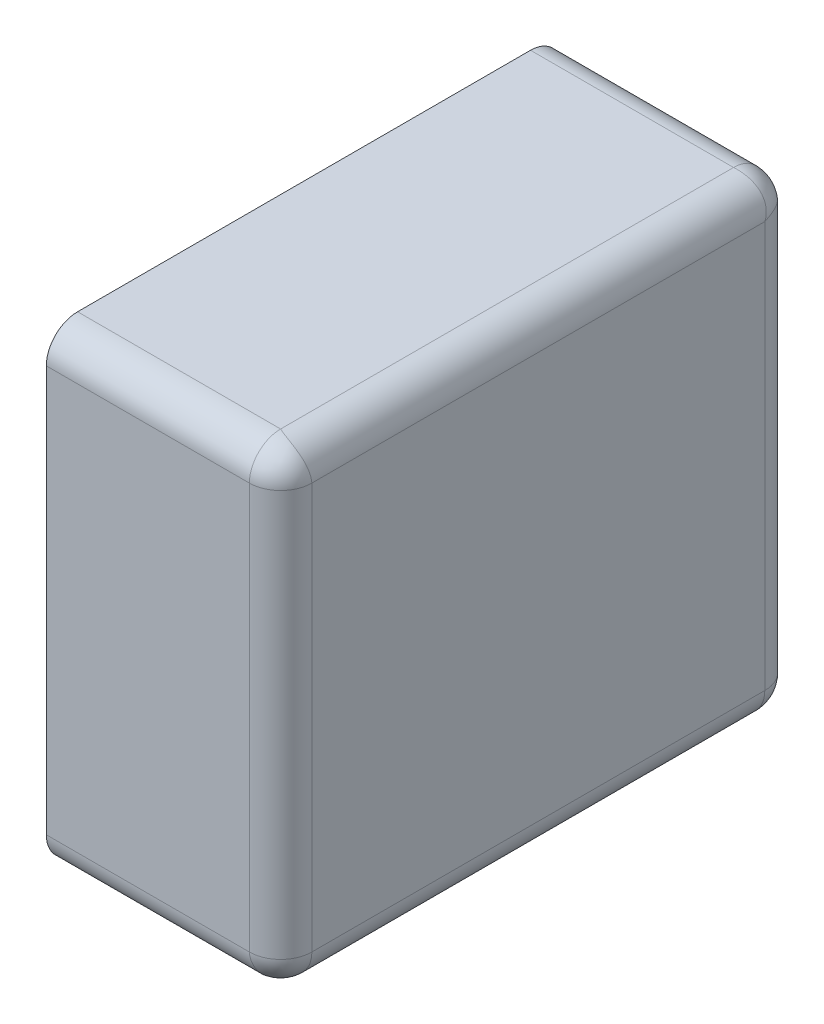
ISO-10303-21;
HEADER;
FILE_DESCRIPTION(('STEP AP214'),'2;1');
FILE_NAME('part.step','',(''),(''),'','','');
FILE_SCHEMA(('AUTOMOTIVE_DESIGN { 1 0 10303 214 1 1 1 1 }'));
ENDSEC;
DATA;
#1=APPLICATION_CONTEXT('core data for automotive mechanical design processes');
#2=APPLICATION_PROTOCOL_DEFINITION('international standard','automotive_design',2000,#1);
#3=PRODUCT_CONTEXT('',#1,'mechanical');
#4=PRODUCT('Part','Part','',(#3));
#5=PRODUCT_RELATED_PRODUCT_CATEGORY('part','',(#4));
#6=PRODUCT_DEFINITION_FORMATION('','',#4);
#7=PRODUCT_DEFINITION_CONTEXT('part definition',#1,'design');
#8=PRODUCT_DEFINITION('design','',#6,#7);
#9=PRODUCT_DEFINITION_SHAPE('','',#8);
#10=(LENGTH_UNIT() NAMED_UNIT(*) SI_UNIT(.MILLI.,.METRE.));
#11=(NAMED_UNIT(*) PLANE_ANGLE_UNIT() SI_UNIT($,.RADIAN.));
#12=(NAMED_UNIT(*) SI_UNIT($,.STERADIAN.) SOLID_ANGLE_UNIT());
#13=UNCERTAINTY_MEASURE_WITH_UNIT(LENGTH_MEASURE(1.E-05),#10,'distance_accuracy_value','');
#14=(GEOMETRIC_REPRESENTATION_CONTEXT(3) GLOBAL_UNCERTAINTY_ASSIGNED_CONTEXT((#13)) GLOBAL_UNIT_ASSIGNED_CONTEXT((#10,
#11,#12)) REPRESENTATION_CONTEXT('',''));
#15=CARTESIAN_POINT('',(0.,0.,0.));
#16=DIRECTION('',(0.,0.,1.));
#17=DIRECTION('',(1.,0.,0.));
#18=AXIS2_PLACEMENT_3D('',#15,#16,#17);
#19=CARTESIAN_POINT('',(0.28,0.611666689445808,0.02));
#20=DIRECTION('',(-0.816496580927726,-0.408248290463864,-0.408248290463862));
#21=DIRECTION('',(0.577350269189626,-0.577350269189626,-0.577350269189626));
#22=AXIS2_PLACEMENT_3D('',#19,#20,#21);
#23=SPHERICAL_SURFACE('',#22,0.02);
#24=CARTESIAN_POINT('',(0.28,0.611666689445808,0.02));
#25=DIRECTION('',(1.,0.,0.));
#26=DIRECTION('',(0.,0.,-1.));
#27=AXIS2_PLACEMENT_3D('',#24,#25,#26);
#28=CIRCLE('',#27,0.02);
#29=CARTESIAN_POINT('',(0.28,0.591666689445808,0.02));
#30=VERTEX_POINT('',#29);
#31=CARTESIAN_POINT('',(0.28,0.611666689445808,0.));
#32=VERTEX_POINT('',#31);
#33=EDGE_CURVE('E11',#30,#32,#28,.T.);
#34=ORIENTED_EDGE('',*,*,#33,.T.);
#35=CARTESIAN_POINT('',(0.28,0.611666689445808,0.02));
#36=DIRECTION('',(0.,-1.,0.));
#37=DIRECTION('',(1.,0.,0.));
#38=AXIS2_PLACEMENT_3D('',#35,#36,#37);
#39=CIRCLE('',#38,0.02);
#40=CARTESIAN_POINT('',(0.3,0.611666689445808,0.02));
#41=VERTEX_POINT('',#40);
#42=EDGE_CURVE('E24',#32,#41,#39,.T.);
#43=ORIENTED_EDGE('',*,*,#42,.T.);
#44=CARTESIAN_POINT('',(0.28,0.611666689445808,0.02));
#45=DIRECTION('',(0.,0.,-1.));
#46=DIRECTION('',(0.,-1.,0.));
#47=AXIS2_PLACEMENT_3D('',#44,#45,#46);
#48=CIRCLE('',#47,0.02);
#49=EDGE_CURVE('E336',#41,#30,#48,.T.);
#50=ORIENTED_EDGE('',*,*,#49,.T.);
#51=EDGE_LOOP('',(#34,#43,#50));
#52=FACE_BOUND('',#51,.T.);
#53=ADVANCED_FACE('F17',(#52),#23,.T.);
#54=CARTESIAN_POINT('',(0.28,0.611666689445808,0.31));
#55=DIRECTION('',(-0.408248290463863,-0.816496580927725,-0.408248290463865));
#56=DIRECTION('',(0.577350269189625,-0.577350269189627,0.577350269189625));
#57=AXIS2_PLACEMENT_3D('',#54,#55,#56);
#58=SPHERICAL_SURFACE('',#57,0.02);
#59=CARTESIAN_POINT('',(0.28,0.611666689445808,0.33));
#60=CARTESIAN_POINT('',(0.280022590656353,0.611334148474741,0.330000008125587));
#61=CARTESIAN_POINT('',(0.280048467324623,0.611001844995877,0.329991668527019));
#62=CARTESIAN_POINT('',(0.280106156478249,0.610337079746307,0.329958278226015));
#63=CARTESIAN_POINT('',(0.280137995200576,0.610004624017193,0.329933152347223));
#64=CARTESIAN_POINT('',(0.280206893868657,0.609340595003377,0.329866039031705));
#65=CARTESIAN_POINT('',(0.280243974413334,0.609009030727827,0.329823983801023));
#66=CARTESIAN_POINT('',(0.280322608326683,0.608347802787663,0.329722948959342));
#67=CARTESIAN_POINT('',(0.2803641771601,0.60801815010292,0.329663909585364));
#68=CARTESIAN_POINT('',(0.280451011501145,0.607361750546147,0.329528916956939));
#69=CARTESIAN_POINT('',(0.280496287947044,0.607035015675078,0.329452912423427));
#70=CARTESIAN_POINT('',(0.28058973767065,0.606385436639111,0.32928407811241));
#71=CARTESIAN_POINT('',(0.280637918049141,0.606062604537353,0.329191205873748));
#72=CARTESIAN_POINT('',(0.28073635687823,0.605421792978829,0.328988802105101));
#73=CARTESIAN_POINT('',(0.28078661935037,0.605103824708536,0.328879237125614));
#74=CARTESIAN_POINT('',(0.28088838941963,0.604473676032253,0.328643691360587));
#75=CARTESIAN_POINT('',(0.280939898771582,0.60416150502494,0.328517686194392));
#76=CARTESIAN_POINT('',(0.281043320324341,0.603543856078688,0.328249580526752));
#77=CARTESIAN_POINT('',(0.281095232865489,0.603238384878659,0.328107464633685));
#78=CARTESIAN_POINT('',(0.28119861409936,0.602635007501095,0.327807534142986));
#79=CARTESIAN_POINT('',(0.281250082594975,0.602337104579366,0.327649712927951));
#80=CARTESIAN_POINT('',(0.281351729565189,0.601749699416992,0.327318843351742));
#81=CARTESIAN_POINT('',(0.281401908192211,0.601460196183228,0.327145796800535));
#82=CARTESIAN_POINT('',(0.28150013473126,0.600890386886022,0.326785021438906));
#83=CARTESIAN_POINT('',(0.281548184027282,0.600610074880339,0.326597302391137));
#84=CARTESIAN_POINT('',(0.281641321625956,0.600059402677607,0.326207798282272));
#85=CARTESIAN_POINT('',(0.281686413406471,0.599789030962054,0.326006030339392));
#86=CARTESIAN_POINT('',(0.28177282100519,0.599258949646601,0.325589113715835));
#87=CARTESIAN_POINT('',(0.281814143222991,0.598999222404694,0.325373988796018));
#88=CARTESIAN_POINT('',(0.281892216861792,0.598491093743794,0.324931109843732));
#89=CARTESIAN_POINT('',(0.281928978383083,0.598242668098217,0.324703385393971));
#90=CARTESIAN_POINT('',(0.281997160659628,0.597757757689727,0.32423612233739));
#91=CARTESIAN_POINT('',(0.28202859593171,0.597521241746488,0.323996618215752));
#92=CARTESIAN_POINT('',(0.282085385217584,0.597060715335748,0.323506670756099));
#93=CARTESIAN_POINT('',(0.28211075880361,0.596836666462132,0.323256265798536));
#94=CARTESIAN_POINT('',(0.282154718170381,0.596401586733098,0.322745447935608));
#95=CARTESIAN_POINT('',(0.282173329127303,0.596190510075537,0.322485076223237));
#96=CARTESIAN_POINT('',(0.282203094935471,0.595781833927346,0.321955308494531));
#97=CARTESIAN_POINT('',(0.2822142810123,0.595584181174223,0.321685955339434));
#98=CARTESIAN_POINT('',(0.282228571117403,0.595202757491672,0.321139256511542));
#99=CARTESIAN_POINT('',(0.282231712751129,0.595018925884465,0.320861954178094));
#100=CARTESIAN_POINT('',(0.282229334285304,0.594665493809618,0.320300432434902));
#101=CARTESIAN_POINT('',(0.282223858375641,0.594495825406103,0.320016255624191));
#102=CARTESIAN_POINT('',(0.282203715057505,0.594171013111566,0.319442099273697));
#103=CARTESIAN_POINT('',(0.28218909849248,0.594015794297807,0.319152160365533));
#104=CARTESIAN_POINT('',(0.282150197448733,0.593720118275401,0.31856762818301));
#105=CARTESIAN_POINT('',(0.28212597039261,0.593579579543217,0.318273072358095));
#106=CARTESIAN_POINT('',(0.282067428373197,0.593313444361489,0.317680483339179));
#107=CARTESIAN_POINT('',(0.282033177188287,0.593187760288434,0.317382483235147));
#108=CARTESIAN_POINT('',(0.28195422644503,0.592951458983836,0.316784206815382));
#109=CARTESIAN_POINT('',(0.281909596642951,0.592840748641457,0.316483958108745));
#110=CARTESIAN_POINT('',(0.281809589319757,0.592634463115031,0.31588240117078));
#111=CARTESIAN_POINT('',(0.281754287007639,0.592538790058148,0.315581114055278));
#112=CARTESIAN_POINT('',(0.281632702159367,0.592362593769109,0.314978718554174));
#113=CARTESIAN_POINT('',(0.281566499584934,0.592281968717724,0.314677623814978));
#114=CARTESIAN_POINT('',(0.281422937490544,0.592135823168081,0.314076824171009));
#115=CARTESIAN_POINT('',(0.281345661932538,0.592070197866407,0.313777124916909));
#116=CARTESIAN_POINT('',(0.281221092947844,0.59198286595166,0.313328778203));
#117=CARTESIAN_POINT('',(0.281178255552711,0.591955665383831,0.313179933041727));
#118=CARTESIAN_POINT('',(0.281089772466679,0.591904985889448,0.312883054971346));
#119=CARTESIAN_POINT('',(0.28104413777645,0.591881493538696,0.312735021096781));
#120=CARTESIAN_POINT('',(0.280950059792531,0.591838212101501,0.312439925078264));
#121=CARTESIAN_POINT('',(0.280901627595711,0.591818409544563,0.312292861368746));
#122=CARTESIAN_POINT('',(0.280801956801604,0.591782484251369,0.311999856728976));
#123=CARTESIAN_POINT('',(0.280750729367382,0.591766348041082,0.311853913656673));
#124=CARTESIAN_POINT('',(0.280645475074276,0.591737729487319,0.311563302522279));
#125=CARTESIAN_POINT('',(0.280591459405113,0.591725233700399,0.31141863173285));
#126=CARTESIAN_POINT('',(0.280480639915912,0.591703866846108,0.311130715857044));
#127=CARTESIAN_POINT('',(0.28042384727353,0.591694982403244,0.310987467462735));
#128=CARTESIAN_POINT('',(0.28030748910873,0.591680806437444,0.310702545780638));
#129=CARTESIAN_POINT('',(0.280247934713586,0.591675501642837,0.310560868611608));
#130=CARTESIAN_POINT('',(0.280126073989553,0.591668449415601,0.310279238132867));
#131=CARTESIAN_POINT('',(0.280063778692528,0.591666688855447,0.310139280377173));
#132=CARTESIAN_POINT('',(0.28,0.591666689445808,0.31));
#133=B_SPLINE_CURVE_WITH_KNOTS('',3,(#59,#60,#61,#62,#63,#64,#65,#66,#67,#68,#69,#70,#71,#72,
#73,#74,#75,#76,#77,#78,#79,#80,#81,#82,#83,#84,#85,#86,#87,#88,#89,#90,#91,#92,#93,#94,#95,#96,
#97,#98,#99,#100,#101,#102,#103,#104,#105,#106,#107,#108,#109,#110,#111,#112,#113,#114,#115,
#116,#117,#118,#119,#120,#121,#122,#123,#124,#125,#126,#127,#128,#129,#130,#131,#132),
.UNSPECIFIED.,.F.,.F.,(4,2,2,2,2,2,2,2,2,2,2,2,2,2,2,2,2,2,2,2,2,2,2,2,2,2,2,2,2,2,2,2,2,2,2,2,
4),(0.,0.000999781399315431,0.00200407054494469,0.00301242204398962,0.00402436601448971,
0.00503941114405151,0.00605704778834485,0.00707675110110723,0.00809798418851635,
0.00912020128176308,0.0101428509224156,0.0111653791557147,0.0121872327272804,0.0132078622788661,
0.0142267255387508,0.0152432905021242,0.0162570385963918,0.0172674678256811,0.0182740958879865,
0.0192764632573068,0.0202741362218112,0.0212667098675017,0.0222538109950035,0.0232351009550113,
0.0242102783855514,0.0251790818315857,0.0261412922246293,0.0270967351970057,0.028045283202207,
0.0285169970770674,0.0289869620593238,0.0294551761814861,0.0299216407082721,0.0303863601707294,
0.0308493423947612,0.0313105985237337,0.031770143034833),.UNSPECIFIED.);
#134=CARTESIAN_POINT('',(0.28,0.611666689445808,0.33));
#135=VERTEX_POINT('',#134);
#136=CARTESIAN_POINT('',(0.28,0.591666689445808,0.31));
#137=VERTEX_POINT('',#136);
#138=EDGE_CURVE('E262',#135,#137,#133,.T.);
#139=ORIENTED_EDGE('',*,*,#138,.T.);
#140=CARTESIAN_POINT('',(0.28,0.611666689445808,0.31));
#141=DIRECTION('',(0.,0.,1.));
#142=DIRECTION('',(1.,0.,0.));
#143=AXIS2_PLACEMENT_3D('',#140,#141,#142);
#144=CIRCLE('',#143,0.02);
#145=CARTESIAN_POINT('',(0.3,0.611666689445808,0.31));
#146=VERTEX_POINT('',#145);
#147=EDGE_CURVE('E258',#137,#146,#144,.T.);
#148=ORIENTED_EDGE('',*,*,#147,.T.);
#149=CARTESIAN_POINT('',(0.28,0.611666689445808,0.31));
#150=DIRECTION('',(0.,-1.,0.));
#151=DIRECTION('',(0.,0.,1.));
#152=AXIS2_PLACEMENT_3D('',#149,#150,#151);
#153=CIRCLE('',#152,0.02);
#154=EDGE_CURVE('E253',#146,#135,#153,.T.);
#155=ORIENTED_EDGE('',*,*,#154,.T.);
#156=EDGE_LOOP('',(#139,#148,#155));
#157=FACE_BOUND('',#156,.T.);
#158=ADVANCED_FACE('F343',(#157),#58,.T.);
#159=CARTESIAN_POINT('',(0.28,0.611666689445808,0.));
#160=DIRECTION('',(0.,0.,1.));
#161=DIRECTION('',(0.707106781186548,-0.707106781186548,0.));
#162=AXIS2_PLACEMENT_3D('',#159,#160,#161);
#163=CYLINDRICAL_SURFACE('',#162,0.02);
#164=ORIENTED_EDGE('',*,*,#147,.F.);
#165=DIRECTION('',(0.,0.,-1.));
#166=VECTOR('',#165,1.);
#167=CARTESIAN_POINT('',(0.28,0.591666689445808,0.));
#168=LINE('',#167,#166);
#169=EDGE_CURVE('E248',#137,#30,#168,.T.);
#170=ORIENTED_EDGE('',*,*,#169,.T.);
#171=ORIENTED_EDGE('',*,*,#49,.F.);
#172=DIRECTION('',(0.,0.,1.));
#173=VECTOR('',#172,1.);
#174=CARTESIAN_POINT('',(0.3,0.611666689445808,0.));
#175=LINE('',#174,#173);
#176=EDGE_CURVE('E245',#41,#146,#175,.T.);
#177=ORIENTED_EDGE('',*,*,#176,.T.);
#178=EDGE_LOOP('',(#164,#170,#171,#177));
#179=FACE_BOUND('',#178,.T.);
#180=ADVANCED_FACE('F228',(#179),#163,.T.);
#181=CARTESIAN_POINT('',(0.28,0.871666689445808,0.02));
#182=DIRECTION('',(-0.816496580927727,0.408248290463863,-0.408248290463861));
#183=DIRECTION('',(0.577350269189624,0.577350269189626,-0.577350269189628));
#184=AXIS2_PLACEMENT_3D('',#181,#182,#183);
#185=SPHERICAL_SURFACE('',#184,0.02);
#186=CARTESIAN_POINT('',(0.3,0.871666689445808,0.02));
#187=CARTESIAN_POINT('',(0.300000000590361,0.871730468138336,0.0198607196228271));
#188=CARTESIAN_POINT('',(0.299998240030207,0.871792763435361,0.0197207618671335));
#189=CARTESIAN_POINT('',(0.299991187802971,0.871914624159394,0.0194391313883916));
#190=CARTESIAN_POINT('',(0.299985883008364,0.871974178554538,0.0192974542193625));
#191=CARTESIAN_POINT('',(0.299971707042564,0.872090536719337,0.0190125325372646));
#192=CARTESIAN_POINT('',(0.2999628225997,0.87214732936172,0.018869284142956));
#193=CARTESIAN_POINT('',(0.299941455745409,0.872258148850921,0.0185813682671499));
#194=CARTESIAN_POINT('',(0.299928959958489,0.872312164520084,0.0184366974777213));
#195=CARTESIAN_POINT('',(0.299900341404726,0.87241741881319,0.0181460863433266));
#196=CARTESIAN_POINT('',(0.299884205194439,0.872468646247412,0.0180001432710243));
#197=CARTESIAN_POINT('',(0.299848279901245,0.872568317041519,0.0177071386312541));
#198=CARTESIAN_POINT('',(0.299828477344307,0.872616749238339,0.0175600749217357));
#199=CARTESIAN_POINT('',(0.299785195907112,0.872710827222257,0.0172649789032189));
#200=CARTESIAN_POINT('',(0.29976170355636,0.872756461912487,0.0171169450286536));
#201=CARTESIAN_POINT('',(0.299711024061977,0.872844944998519,0.0168200669582726));
#202=CARTESIAN_POINT('',(0.299683823494148,0.872887782393652,0.0166712217969997));
#203=CARTESIAN_POINT('',(0.299596491579401,0.873012351378346,0.0162228750830907));
#204=CARTESIAN_POINT('',(0.299530866277727,0.873089626936352,0.0159231758289911));
#205=CARTESIAN_POINT('',(0.299384720728084,0.873233189030742,0.0153223761850222));
#206=CARTESIAN_POINT('',(0.299304095676699,0.873299391605175,0.0150212814458264));
#207=CARTESIAN_POINT('',(0.29912789938766,0.873420976453447,0.0144188859447218));
#208=CARTESIAN_POINT('',(0.299032226330777,0.873476278765565,0.0141175988292196));
#209=CARTESIAN_POINT('',(0.298825940804351,0.873576286088758,0.0135160418912551));
#210=CARTESIAN_POINT('',(0.298715230461972,0.873620915890838,0.0132157931846183));
#211=CARTESIAN_POINT('',(0.298478929157374,0.873699866634095,0.0126175167648527));
#212=CARTESIAN_POINT('',(0.298353245084319,0.873734117819005,0.012319516660821));
#213=CARTESIAN_POINT('',(0.298087109902591,0.873792659838418,0.0117269276419048));
#214=CARTESIAN_POINT('',(0.297946571170407,0.873816886894541,0.0114323718169895));
#215=CARTESIAN_POINT('',(0.297650895148002,0.873855787938288,0.0108478396344671));
#216=CARTESIAN_POINT('',(0.297495676334242,0.873870404503313,0.0105579007263027));
#217=CARTESIAN_POINT('',(0.297170864039705,0.873890547821449,0.00998374437580919));
#218=CARTESIAN_POINT('',(0.297001195636191,0.873896023731112,0.00969956756509782));
#219=CARTESIAN_POINT('',(0.296647763561343,0.873898402196938,0.00913804582190597));
#220=CARTESIAN_POINT('',(0.296463931954136,0.873895260563211,0.00886074348845804));
#221=CARTESIAN_POINT('',(0.296082508271585,0.873880970458108,0.00831404466056605));
#222=CARTESIAN_POINT('',(0.295884855518462,0.873869784381279,0.00804469150546922));
#223=CARTESIAN_POINT('',(0.29547617937027,0.873840018573111,0.00751492377676279));
#224=CARTESIAN_POINT('',(0.29526510271271,0.87382140761619,0.00725455206439161));
#225=CARTESIAN_POINT('',(0.294830022983676,0.873777448249418,0.00674373420146366));
#226=CARTESIAN_POINT('',(0.294605974110061,0.873752074663392,0.00649332924390105));
#227=CARTESIAN_POINT('',(0.29414544769932,0.873695285377518,0.00600338178424781));
#228=CARTESIAN_POINT('',(0.293908931756081,0.873663850105436,0.00576387766260968));
#229=CARTESIAN_POINT('',(0.293424021347592,0.873595667828891,0.00529661460602938));
#230=CARTESIAN_POINT('',(0.293175595702015,0.8735589063076,0.00506889015626833));
#231=CARTESIAN_POINT('',(0.292667467041114,0.873480832668799,0.00462601120398246));
#232=CARTESIAN_POINT('',(0.292407739799207,0.873439510450998,0.00441088628416467));
#233=CARTESIAN_POINT('',(0.291877658483754,0.873353102852279,0.00399396966060765));
#234=CARTESIAN_POINT('',(0.291607286768201,0.873308011071765,0.00379220171772828));
#235=CARTESIAN_POINT('',(0.291056614565469,0.87321487347309,0.00340269760886272));
#236=CARTESIAN_POINT('',(0.290776302559786,0.873166824177068,0.00321497856109427));
#237=CARTESIAN_POINT('',(0.29020649326258,0.873068597638019,0.00285420319946529));
#238=CARTESIAN_POINT('',(0.289916990028816,0.873018419010997,0.00268115664825788));
#239=CARTESIAN_POINT('',(0.289329584866442,0.872916772040783,0.00235028707204871));
#240=CARTESIAN_POINT('',(0.289031681944713,0.872865303545168,0.00219246585701409));
#241=CARTESIAN_POINT('',(0.288428304567149,0.872761922311297,0.00189253536631513));
#242=CARTESIAN_POINT('',(0.288122833367121,0.872710009770149,0.00175041947324791));
#243=CARTESIAN_POINT('',(0.287505184420868,0.87260658821739,0.00148231380560814));
#244=CARTESIAN_POINT('',(0.287193013413555,0.872555078865438,0.0013563086394134));
#245=CARTESIAN_POINT('',(0.286562864737272,0.872453308796178,0.00112076287438578));
#246=CARTESIAN_POINT('',(0.286244896466979,0.872403046324038,0.00101119789489932));
#247=CARTESIAN_POINT('',(0.285604084908455,0.872304607494949,0.000808794126252359));
#248=CARTESIAN_POINT('',(0.285281252806697,0.872256427116458,0.000715921887590404));
#249=CARTESIAN_POINT('',(0.28463167377073,0.872162977392852,0.000547087576573233));
#250=CARTESIAN_POINT('',(0.284304938899661,0.872117700946953,0.000471083043060662));
#251=CARTESIAN_POINT('',(0.283648539342888,0.872030866605908,0.00033609041463642));
#252=CARTESIAN_POINT('',(0.283318886658145,0.871989297772491,0.000277051040657805));
#253=CARTESIAN_POINT('',(0.282657658717981,0.871910663859142,0.000176016198976993));
#254=CARTESIAN_POINT('',(0.282326094442431,0.871873583314465,0.000133960968295318));
#255=CARTESIAN_POINT('',(0.281662065428615,0.871804684646384,6.68476527768222E-05));
#256=CARTESIAN_POINT('',(0.281329609699501,0.871772845924057,4.17217739850229E-05));
#257=CARTESIAN_POINT('',(0.280664844449931,0.871715156770431,8.33147298054421E-06));
#258=CARTESIAN_POINT('',(0.280332540971067,0.871689280102161,-8.12558677261846E-09));
#259=CARTESIAN_POINT('',(0.28,0.871666689445808,0.));
#260=B_SPLINE_CURVE_WITH_KNOTS('',3,(#186,#187,#188,#189,#190,#191,#192,#193,#194,#195,#196,
#197,#198,#199,#200,#201,#202,#203,#204,#205,#206,#207,#208,#209,#210,#211,#212,#213,#214,#215,
#216,#217,#218,#219,#220,#221,#222,#223,#224,#225,#226,#227,#228,#229,#230,#231,#232,#233,#234,
#235,#236,#237,#238,#239,#240,#241,#242,#243,#244,#245,#246,#247,#248,#249,#250,#251,#252,#253,
#254,#255,#256,#257,#258,#259),.UNSPECIFIED.,.F.,.F.,(4,2,2,2,2,2,2,2,2,2,2,2,2,2,2,2,2,2,2,2,2,
2,2,2,2,2,2,2,2,2,2,2,2,2,2,2,4),(0.,0.000459544511099279,0.000920800640071707,
0.00138378286410355,0.0018485023265608,0.00231496685334685,0.00278318097550909,
0.00325314595776555,0.00372485983262588,0.00467340783782725,0.00562885081020362,
0.00659106120324724,0.00755986464928153,0.00853504207982159,0.00951633203982944,
0.0105034331673312,0.0114960068130218,0.0124936797775262,0.0134960471468464,0.0145026752091519,
0.0155131044384412,0.0165268525327087,0.0175434174960822,0.0185622807559668,0.0195829103075526,
0.0206047638791183,0.0216272921124173,0.0226499417530699,0.0236721588463166,0.0246933919337258,
0.0257130952464882,0.0267307318907814,0.0277457770203433,0.0287577209908433,0.0297660724898882,
0.0307703616355175,0.031770143034833),.UNSPECIFIED.);
#261=CARTESIAN_POINT('',(0.3,0.871666689445808,0.02));
#262=VERTEX_POINT('',#261);
#263=CARTESIAN_POINT('',(0.28,0.871666689445808,0.));
#264=VERTEX_POINT('',#263);
#265=EDGE_CURVE('E243',#262,#264,#260,.T.);
#266=ORIENTED_EDGE('',*,*,#265,.T.);
#267=CARTESIAN_POINT('',(0.28,0.871666689445808,0.02));
#268=DIRECTION('',(1.,0.,0.));
#269=DIRECTION('',(0.,1.,0.));
#270=AXIS2_PLACEMENT_3D('',#267,#268,#269);
#271=CIRCLE('',#270,0.02);
#272=CARTESIAN_POINT('',(0.28,0.891666689445808,0.02));
#273=VERTEX_POINT('',#272);
#274=EDGE_CURVE('E288',#264,#273,#271,.T.);
#275=ORIENTED_EDGE('',*,*,#274,.T.);
#276=CARTESIAN_POINT('',(0.28,0.891666689445808,0.02));
#277=CARTESIAN_POINT('',(0.280332540971067,0.891666697571395,0.0199774093436473));
#278=CARTESIAN_POINT('',(0.280664844449931,0.891658357972828,0.0199515326753773));
#279=CARTESIAN_POINT('',(0.281329609699501,0.891624967671823,0.0198938435217508));
#280=CARTESIAN_POINT('',(0.281662065428615,0.891599841793031,0.0198620047994243));
#281=CARTESIAN_POINT('',(0.282326094442431,0.891532728477513,0.0197931061313426));
#282=CARTESIAN_POINT('',(0.282657658717981,0.891490673246831,0.0197560255866657));
#283=CARTESIAN_POINT('',(0.283318886658145,0.89138963840515,0.0196773916733174));
#284=CARTESIAN_POINT('',(0.283648539342888,0.891330599031172,0.0196358228398999));
#285=CARTESIAN_POINT('',(0.284304938899661,0.891195606402747,0.0195489884988552));
#286=CARTESIAN_POINT('',(0.28463167377073,0.891119601869235,0.0195037120529565));
#287=CARTESIAN_POINT('',(0.285281252806697,0.890950767558218,0.0194102623293496));
#288=CARTESIAN_POINT('',(0.285604084908455,0.890857895319556,0.0193620819508587));
#289=CARTESIAN_POINT('',(0.286244896466979,0.890655491550909,0.0192636431217698));
#290=CARTESIAN_POINT('',(0.286562864737272,0.890545926571422,0.0192133806496299));
#291=CARTESIAN_POINT('',(0.287193013413555,0.890310380806395,0.0191116105803702));
#292=CARTESIAN_POINT('',(0.287505184420868,0.8901843756402,0.0190601012284176));
#293=CARTESIAN_POINT('',(0.288122833367121,0.88991626997256,0.0189566796756587));
#294=CARTESIAN_POINT('',(0.288428304567149,0.889774154079493,0.018904767134511));
#295=CARTESIAN_POINT('',(0.289031681944713,0.889474223588794,0.0188013859006402));
#296=CARTESIAN_POINT('',(0.289329584866442,0.889316402373759,0.0187499174050251));
#297=CARTESIAN_POINT('',(0.289916990028817,0.88898553279755,0.0186482704348113));
#298=CARTESIAN_POINT('',(0.29020649326258,0.888812486246343,0.0185980918077888));
#299=CARTESIAN_POINT('',(0.290776302559786,0.888451710884714,0.0184998652687403));
#300=CARTESIAN_POINT('',(0.291056614565469,0.888263991836945,0.018451815972718));
#301=CARTESIAN_POINT('',(0.291607286768201,0.88787448772808,0.0183586783740435));
#302=CARTESIAN_POINT('',(0.291877658483754,0.8876727197852,0.0183135865935291));
#303=CARTESIAN_POINT('',(0.292407739799207,0.887255803161643,0.0182271789948101));
#304=CARTESIAN_POINT('',(0.292667467041114,0.887040678241826,0.0181858567770088));
#305=CARTESIAN_POINT('',(0.293175595702015,0.88659779928954,0.0181077831382082));
#306=CARTESIAN_POINT('',(0.293424021347592,0.886370074839779,0.0180710216169169));
#307=CARTESIAN_POINT('',(0.293908931756081,0.885902811783198,0.0180028393403716));
#308=CARTESIAN_POINT('',(0.29414544769932,0.88566330766156,0.0179714040682899));
#309=CARTESIAN_POINT('',(0.294605974110061,0.885173360201907,0.0179146147824163));
#310=CARTESIAN_POINT('',(0.294830022983676,0.884922955244344,0.0178892411963896));
#311=CARTESIAN_POINT('',(0.29526510271271,0.884412137381416,0.0178452818296186));
#312=CARTESIAN_POINT('',(0.295476179370271,0.884151765669045,0.0178266708726966));
#313=CARTESIAN_POINT('',(0.295884855518462,0.883621997940339,0.0177969050645286));
#314=CARTESIAN_POINT('',(0.296082508271585,0.883352644785242,0.0177857189876999));
#315=CARTESIAN_POINT('',(0.296463931954136,0.88280594595735,0.0177714288825966));
#316=CARTESIAN_POINT('',(0.296647763561343,0.882528643623902,0.0177682872488705));
#317=CARTESIAN_POINT('',(0.297001195636191,0.88196712188071,0.0177706657146956));
#318=CARTESIAN_POINT('',(0.297170864039705,0.881682945069999,0.0177761416243585));
#319=CARTESIAN_POINT('',(0.297495676334242,0.881108788719505,0.0177962849424949));
#320=CARTESIAN_POINT('',(0.297650895148002,0.880818849811341,0.0178109015075204));
#321=CARTESIAN_POINT('',(0.297946571170407,0.880234317628819,0.0178498025512674));
#322=CARTESIAN_POINT('',(0.298087109902591,0.879939761803903,0.0178740296073897));
#323=CARTESIAN_POINT('',(0.298353245084319,0.879347172784987,0.0179325716268031));
#324=CARTESIAN_POINT('',(0.298478929157374,0.879049172680955,0.0179668228117131));
#325=CARTESIAN_POINT('',(0.298715230461972,0.87845089626119,0.01804577355497));
#326=CARTESIAN_POINT('',(0.298825940804351,0.878150647554553,0.0180904033570495));
#327=CARTESIAN_POINT('',(0.299032226330777,0.877549090616588,0.0181904106802428));
#328=CARTESIAN_POINT('',(0.29912789938766,0.877247803501086,0.0182457129923607));
#329=CARTESIAN_POINT('',(0.299304095676699,0.876645407999982,0.0183672978406332));
#330=CARTESIAN_POINT('',(0.299384720728084,0.876344313260786,0.0184335004150665));
#331=CARTESIAN_POINT('',(0.299530866277727,0.875743513616817,0.0185770625094562));
#332=CARTESIAN_POINT('',(0.299596491579401,0.875443814362717,0.0186543380674616));
#333=CARTESIAN_POINT('',(0.299683823494148,0.874995467648808,0.0187789070521562));
#334=CARTESIAN_POINT('',(0.299711024061977,0.874846622487536,0.0188217444472892));
#335=CARTESIAN_POINT('',(0.29976170355636,0.874549744417154,0.018910227533321));
#336=CARTESIAN_POINT('',(0.299785195907112,0.874401710542589,0.0189558622235505));
#337=CARTESIAN_POINT('',(0.299828477344307,0.874106614524072,0.019049940207469));
#338=CARTESIAN_POINT('',(0.299848279901245,0.873959550814554,0.0190983724042887));
#339=CARTESIAN_POINT('',(0.299884205194439,0.873666546174784,0.0191980431983957));
#340=CARTESIAN_POINT('',(0.299900341404726,0.873520603102481,0.019249270632618));
#341=CARTESIAN_POINT('',(0.299928959958489,0.873229991968087,0.0193545249257238));
#342=CARTESIAN_POINT('',(0.299941455745409,0.873085321178658,0.0194085405948874));
#343=CARTESIAN_POINT('',(0.2999628225997,0.872797405302852,0.0195193600840876));
#344=CARTESIAN_POINT('',(0.299971707042564,0.872654156908544,0.0195761527264704));
#345=CARTESIAN_POINT('',(0.299985883008364,0.872369235226446,0.0196925108912696));
#346=CARTESIAN_POINT('',(0.299991187802971,0.872227558057416,0.0197520652864141));
#347=CARTESIAN_POINT('',(0.299998240030207,0.871945927578675,0.0198739260104468));
#348=CARTESIAN_POINT('',(0.300000000590361,0.871805969822981,0.0199362213074718));
#349=CARTESIAN_POINT('',(0.3,0.871666689445808,0.0199999999999999));
#350=B_SPLINE_CURVE_WITH_KNOTS('',3,(#276,#277,#278,#279,#280,#281,#282,#283,#284,#285,#286,
#287,#288,#289,#290,#291,#292,#293,#294,#295,#296,#297,#298,#299,#300,#301,#302,#303,#304,#305,
#306,#307,#308,#309,#310,#311,#312,#313,#314,#315,#316,#317,#318,#319,#320,#321,#322,#323,#324,
#325,#326,#327,#328,#329,#330,#331,#332,#333,#334,#335,#336,#337,#338,#339,#340,#341,#342,#343,
#344,#345,#346,#347,#348,#349),.UNSPECIFIED.,.F.,.F.,(4,2,2,2,2,2,2,2,2,2,2,2,2,2,2,2,2,2,2,2,2,
2,2,2,2,2,2,2,2,2,2,2,2,2,2,2,4),(0.,0.000999781399315437,0.0020040705449447,
0.00301242204398967,0.00402436601448971,0.00503941114405157,0.00605704778834485,
0.0070767511011072,0.00809798418851638,0.00912020128176308,0.0101428509224156,
0.0111653791557147,0.0121872327272804,0.0132078622788662,0.0142267255387507,0.0152432905021242,
0.0162570385963919,0.0172674678256811,0.0182740958879865,0.0192764632573068,0.0202741362218111,
0.0212667098675017,0.0222538109950035,0.0232351009550113,0.0242102783855514,0.0251790818315857,
0.0261412922246293,0.0270967351970057,0.028045283202207,0.0285169970770674,0.0289869620593239,
0.0294551761814861,0.0299216407082721,0.0303863601707294,0.0308493423947612,0.0313105985237336,
0.031770143034833),.UNSPECIFIED.);
#351=EDGE_CURVE('E211',#273,#262,#350,.T.);
#352=ORIENTED_EDGE('',*,*,#351,.T.);
#353=EDGE_LOOP('',(#266,#275,#352));
#354=FACE_BOUND('',#353,.T.);
#355=ADVANCED_FACE('F218',(#354),#185,.T.);
#356=CARTESIAN_POINT('',(0.2625,0.871666689445808,0.02));
#357=DIRECTION('',(1.,0.,0.));
#358=DIRECTION('',(0.,0.707106781186548,-0.707106781186547));
#359=AXIS2_PLACEMENT_3D('',#356,#357,#358);
#360=CYLINDRICAL_SURFACE('',#359,0.02);
#361=CARTESIAN_POINT('',(0.15,0.871666689445808,0.02));
#362=DIRECTION('',(1.,0.,0.));
#363=DIRECTION('',(0.,0.707106781186548,-0.707106781186547));
#364=AXIS2_PLACEMENT_3D('',#361,#362,#363);
#365=CIRCLE('',#364,0.02);
#366=CARTESIAN_POINT('',(0.15,0.871666689445808,0.));
#367=VERTEX_POINT('',#366);
#368=CARTESIAN_POINT('',(0.15,0.891666689445808,0.02));
#369=VERTEX_POINT('',#368);
#370=EDGE_CURVE('E201',#367,#369,#365,.T.);
#371=ORIENTED_EDGE('',*,*,#370,.T.);
#372=DIRECTION('',(1.,0.,0.));
#373=VECTOR('',#372,1.);
#374=CARTESIAN_POINT('',(0.2625,0.891666689445808,0.02));
#375=LINE('',#374,#373);
#376=EDGE_CURVE('E295',#369,#273,#375,.T.);
#377=ORIENTED_EDGE('',*,*,#376,.T.);
#378=ORIENTED_EDGE('',*,*,#274,.F.);
#379=DIRECTION('',(-1.,0.,0.));
#380=VECTOR('',#379,1.);
#381=CARTESIAN_POINT('',(0.2625,0.871666689445808,0.));
#382=LINE('',#381,#380);
#383=EDGE_CURVE('E299',#264,#367,#382,.T.);
#384=ORIENTED_EDGE('',*,*,#383,.T.);
#385=EDGE_LOOP('',(#371,#377,#378,#384));
#386=FACE_BOUND('',#385,.T.);
#387=ADVANCED_FACE('F227',(#386),#360,.T.);
#388=CARTESIAN_POINT('',(0.28,0.871666689445808,0.31));
#389=DIRECTION('',(0.408248290463863,-0.816496580927726,0.408248290463863));
#390=DIRECTION('',(0.577350269189624,0.577350269189626,0.577350269189627));
#391=AXIS2_PLACEMENT_3D('',#388,#389,#390);
#392=SPHERICAL_SURFACE('',#391,0.02);
#393=CARTESIAN_POINT('',(0.28,0.871666689445808,0.31));
#394=DIRECTION('',(0.,1.,0.));
#395=DIRECTION('',(1.,0.,0.));
#396=AXIS2_PLACEMENT_3D('',#393,#394,#395);
#397=CIRCLE('',#396,0.02);
#398=CARTESIAN_POINT('',(0.28,0.871666689445808,0.33));
#399=VERTEX_POINT('',#398);
#400=CARTESIAN_POINT('',(0.3,0.871666689445808,0.31));
#401=VERTEX_POINT('',#400);
#402=EDGE_CURVE('E301',#399,#401,#397,.T.);
#403=ORIENTED_EDGE('',*,*,#402,.T.);
#404=CARTESIAN_POINT('',(0.3,0.871666689445808,0.31));
#405=CARTESIAN_POINT('',(0.300000008125587,0.871999230416875,0.310022590656353));
#406=CARTESIAN_POINT('',(0.299991668527019,0.872331533895739,0.310048467324623));
#407=CARTESIAN_POINT('',(0.299958278226015,0.872996299145309,0.310106156478249));
#408=CARTESIAN_POINT('',(0.299933152347223,0.873328754874423,0.310137995200576));
#409=CARTESIAN_POINT('',(0.299866039031705,0.873992783888239,0.310206893868657));
#410=CARTESIAN_POINT('',(0.299823983801023,0.874324348163789,0.310243974413334));
#411=CARTESIAN_POINT('',(0.299722948959342,0.874985576103953,0.310322608326683));
#412=CARTESIAN_POINT('',(0.299663909585364,0.875315228788696,0.3103641771601));
#413=CARTESIAN_POINT('',(0.299528916956939,0.875971628345469,0.310451011501145));
#414=CARTESIAN_POINT('',(0.299452912423427,0.876298363216538,0.310496287947043));
#415=CARTESIAN_POINT('',(0.29928407811241,0.876947942252505,0.31058973767065));
#416=CARTESIAN_POINT('',(0.299191205873748,0.877270774354263,0.310637918049141));
#417=CARTESIAN_POINT('',(0.298988802105101,0.877911585912787,0.31073635687823));
#418=CARTESIAN_POINT('',(0.298879237125614,0.87822955418308,0.31078661935037));
#419=CARTESIAN_POINT('',(0.298643691360587,0.878859702859363,0.31088838941963));
#420=CARTESIAN_POINT('',(0.298517686194392,0.879171873866676,0.310939898771582));
#421=CARTESIAN_POINT('',(0.298249580526752,0.879789522812929,0.311043320324341));
#422=CARTESIAN_POINT('',(0.298107464633685,0.880094994012957,0.311095232865489));
#423=CARTESIAN_POINT('',(0.297807534142986,0.880698371390522,0.31119861409936));
#424=CARTESIAN_POINT('',(0.297649712927951,0.88099627431225,0.311250082594975));
#425=CARTESIAN_POINT('',(0.297318843351742,0.881583679474625,0.311351729565189));
#426=CARTESIAN_POINT('',(0.297145796800535,0.881873182708388,0.311401908192211));
#427=CARTESIAN_POINT('',(0.296785021438906,0.882442992005594,0.31150013473126));
#428=CARTESIAN_POINT('',(0.296597302391137,0.882723304011277,0.311548184027282));
#429=CARTESIAN_POINT('',(0.296207798282272,0.883273976214009,0.311641321625956));
#430=CARTESIAN_POINT('',(0.296006030339392,0.883544347929562,0.311686413406471));
#431=CARTESIAN_POINT('',(0.295589113715835,0.884074429245015,0.31177282100519));
#432=CARTESIAN_POINT('',(0.295373988796018,0.884334156486922,0.311814143222991));
#433=CARTESIAN_POINT('',(0.294931109843732,0.884842285147823,0.311892216861792));
#434=CARTESIAN_POINT('',(0.294703385393971,0.8850907107934,0.311928978383083));
#435=CARTESIAN_POINT('',(0.29423612233739,0.885575621201889,0.311997160659628));
#436=CARTESIAN_POINT('',(0.293996618215752,0.885812137145128,0.31202859593171));
#437=CARTESIAN_POINT('',(0.293506670756099,0.886272663555869,0.312085385217584));
#438=CARTESIAN_POINT('',(0.293256265798536,0.886496712429484,0.31211075880361));
#439=CARTESIAN_POINT('',(0.292745447935608,0.886931792158518,0.312154718170381));
#440=CARTESIAN_POINT('',(0.292485076223237,0.887142868816079,0.312173329127303));
#441=CARTESIAN_POINT('',(0.291955308494531,0.88755154496427,0.312203094935471));
#442=CARTESIAN_POINT('',(0.291685955339434,0.887749197717393,0.3122142810123));
#443=CARTESIAN_POINT('',(0.291139256511542,0.888130621399944,0.312228571117403));
#444=CARTESIAN_POINT('',(0.290861954178094,0.888314453007151,0.312231712751129));
#445=CARTESIAN_POINT('',(0.290300432434902,0.888667885081999,0.312229334285304));
#446=CARTESIAN_POINT('',(0.290016255624191,0.888837553485513,0.312223858375641));
#447=CARTESIAN_POINT('',(0.289442099273697,0.88916236578005,0.312203715057505));
#448=CARTESIAN_POINT('',(0.289152160365533,0.889317584593809,0.31218909849248));
#449=CARTESIAN_POINT('',(0.28856762818301,0.889613260616215,0.312150197448733));
#450=CARTESIAN_POINT('',(0.288273072358095,0.889753799348399,0.31212597039261));
#451=CARTESIAN_POINT('',(0.287680483339179,0.890019934530127,0.312067428373197));
#452=CARTESIAN_POINT('',(0.287382483235147,0.890145618603182,0.312033177188287));
#453=CARTESIAN_POINT('',(0.286784206815382,0.89038191990778,0.31195422644503));
#454=CARTESIAN_POINT('',(0.286483958108745,0.890492630250159,0.31190959664295));
#455=CARTESIAN_POINT('',(0.28588240117078,0.890698915776585,0.311809589319757));
#456=CARTESIAN_POINT('',(0.285581114055278,0.890794588833468,0.311754287007639));
#457=CARTESIAN_POINT('',(0.284978718554174,0.890970785122507,0.311632702159367));
#458=CARTESIAN_POINT('',(0.284677623814978,0.891051410173892,0.311566499584933));
#459=CARTESIAN_POINT('',(0.284076824171009,0.891197555723535,0.311422937490544));
#460=CARTESIAN_POINT('',(0.283777124916909,0.891263181025209,0.311345661932538));
#461=CARTESIAN_POINT('',(0.283328778203,0.891350512939956,0.311221092947844));
#462=CARTESIAN_POINT('',(0.283179933041727,0.891377713507785,0.311178255552711));
#463=CARTESIAN_POINT('',(0.282883054971346,0.891428393002168,0.311089772466679));
#464=CARTESIAN_POINT('',(0.282735021096781,0.89145188535292,0.311044137776449));
#465=CARTESIAN_POINT('',(0.282439925078264,0.891495166790115,0.310950059792531));
#466=CARTESIAN_POINT('',(0.282292861368746,0.891514969347054,0.310901627595711));
#467=CARTESIAN_POINT('',(0.281999856728976,0.891550894640247,0.310801956801604));
#468=CARTESIAN_POINT('',(0.281853913656673,0.891567030850534,0.310750729367382));
#469=CARTESIAN_POINT('',(0.281563302522279,0.891595649404297,0.310645475074276));
#470=CARTESIAN_POINT('',(0.28141863173285,0.891608145191217,0.310591459405113));
#471=CARTESIAN_POINT('',(0.281130715857044,0.891629512045508,0.310480639915912));
#472=CARTESIAN_POINT('',(0.280987467462735,0.891638396488372,0.31042384727353));
#473=CARTESIAN_POINT('',(0.280702545780637,0.891652572454172,0.31030748910873));
#474=CARTESIAN_POINT('',(0.280560868611608,0.891657877248779,0.310247934713586));
#475=CARTESIAN_POINT('',(0.280279238132866,0.891664929476015,0.310126073989553));
#476=CARTESIAN_POINT('',(0.280139280377173,0.891666690036169,0.310063778692528));
#477=CARTESIAN_POINT('',(0.28,0.891666689445808,0.31));
#478=B_SPLINE_CURVE_WITH_KNOTS('',3,(#404,#405,#406,#407,#408,#409,#410,#411,#412,#413,#414,
#415,#416,#417,#418,#419,#420,#421,#422,#423,#424,#425,#426,#427,#428,#429,#430,#431,#432,#433,
#434,#435,#436,#437,#438,#439,#440,#441,#442,#443,#444,#445,#446,#447,#448,#449,#450,#451,#452,
#453,#454,#455,#456,#457,#458,#459,#460,#461,#462,#463,#464,#465,#466,#467,#468,#469,#470,#471,
#472,#473,#474,#475,#476,#477),.UNSPECIFIED.,.F.,.F.,(4,2,2,2,2,2,2,2,2,2,2,2,2,2,2,2,2,2,2,2,2,
2,2,2,2,2,2,2,2,2,2,2,2,2,2,2,4),(0.,0.000999781399315435,0.0020040705449447,
0.00301242204398963,0.00402436601448971,0.0050394111440515,0.00605704778834485,
0.00707675110110723,0.00809798418851636,0.00912020128176309,0.0101428509224156,
0.0111653791557147,0.0121872327272804,0.0132078622788662,0.0142267255387508,0.0152432905021242,
0.0162570385963919,0.0172674678256811,0.0182740958879865,0.0192764632573068,0.0202741362218112,
0.0212667098675017,0.0222538109950035,0.0232351009550113,0.0242102783855514,0.0251790818315857,
0.0261412922246294,0.0270967351970058,0.0280452832022071,0.0285169970770675,0.0289869620593239,
0.0294551761814861,0.0299216407082722,0.0303863601707294,0.0308493423947613,0.0313105985237337,
0.031770143034833),.UNSPECIFIED.);
#479=CARTESIAN_POINT('',(0.28,0.891666689445808,0.31));
#480=VERTEX_POINT('',#479);
#481=EDGE_CURVE('E172',#401,#480,#478,.T.);
#482=ORIENTED_EDGE('',*,*,#481,.T.);
#483=CARTESIAN_POINT('',(0.28,0.871666689445808,0.31));
#484=DIRECTION('',(1.,0.,0.));
#485=DIRECTION('',(0.,0.,1.));
#486=AXIS2_PLACEMENT_3D('',#483,#484,#485);
#487=CIRCLE('',#486,0.02);
#488=EDGE_CURVE('E167',#480,#399,#487,.T.);
#489=ORIENTED_EDGE('',*,*,#488,.T.);
#490=EDGE_LOOP('',(#403,#482,#489));
#491=FACE_BOUND('',#490,.T.);
#492=ADVANCED_FACE('F190',(#491),#392,.T.);
#493=CARTESIAN_POINT('',(0.28,0.871666689445808,0.));
#494=DIRECTION('',(0.,0.,1.));
#495=DIRECTION('',(0.707106781186546,0.707106781186549,0.));
#496=AXIS2_PLACEMENT_3D('',#493,#494,#495);
#497=CYLINDRICAL_SURFACE('',#496,0.02);
#498=ORIENTED_EDGE('',*,*,#481,.F.);
#499=DIRECTION('',(0.,0.,-1.));
#500=VECTOR('',#499,1.);
#501=CARTESIAN_POINT('',(0.3,0.871666689445808,0.));
#502=LINE('',#501,#500);
#503=EDGE_CURVE('E162',#401,#262,#502,.T.);
#504=ORIENTED_EDGE('',*,*,#503,.T.);
#505=ORIENTED_EDGE('',*,*,#351,.F.);
#506=DIRECTION('',(0.,0.,1.));
#507=VECTOR('',#506,1.);
#508=CARTESIAN_POINT('',(0.28,0.891666689445808,0.));
#509=LINE('',#508,#507);
#510=EDGE_CURVE('E157',#273,#480,#509,.T.);
#511=ORIENTED_EDGE('',*,*,#510,.T.);
#512=EDGE_LOOP('',(#498,#504,#505,#511));
#513=FACE_BOUND('',#512,.T.);
#514=ADVANCED_FACE('F179',(#513),#497,.T.);
#515=CARTESIAN_POINT('',(0.2625,0.871666689445808,0.31));
#516=DIRECTION('',(-1.,0.,0.));
#517=DIRECTION('',(0.,0.707106781186548,0.707106781186548));
#518=AXIS2_PLACEMENT_3D('',#515,#516,#517);
#519=CYLINDRICAL_SURFACE('',#518,0.02);
#520=CARTESIAN_POINT('',(0.15,0.871666689445808,0.31));
#521=DIRECTION('',(1.,0.,0.));
#522=DIRECTION('',(0.,0.707106781186548,0.707106781186548));
#523=AXIS2_PLACEMENT_3D('',#520,#521,#522);
#524=CIRCLE('',#523,0.02);
#525=CARTESIAN_POINT('',(0.15,0.891666689445808,0.31));
#526=VERTEX_POINT('',#525);
#527=CARTESIAN_POINT('',(0.15,0.871666689445808,0.33));
#528=VERTEX_POINT('',#527);
#529=EDGE_CURVE('E155',#526,#528,#524,.T.);
#530=ORIENTED_EDGE('',*,*,#529,.T.);
#531=DIRECTION('',(1.,0.,0.));
#532=VECTOR('',#531,1.);
#533=CARTESIAN_POINT('',(0.2625,0.871666689445808,0.33));
#534=LINE('',#533,#532);
#535=EDGE_CURVE('E152',#528,#399,#534,.T.);
#536=ORIENTED_EDGE('',*,*,#535,.T.);
#537=ORIENTED_EDGE('',*,*,#488,.F.);
#538=DIRECTION('',(-1.,0.,0.));
#539=VECTOR('',#538,1.);
#540=CARTESIAN_POINT('',(0.2625,0.891666689445808,0.31));
#541=LINE('',#540,#539);
#542=EDGE_CURVE('E147',#480,#526,#541,.T.);
#543=ORIENTED_EDGE('',*,*,#542,.T.);
#544=EDGE_LOOP('',(#530,#536,#537,#543));
#545=FACE_BOUND('',#544,.T.);
#546=ADVANCED_FACE('F189',(#545),#519,.T.);
#547=CARTESIAN_POINT('',(0.28,0.666666689445808,0.31));
#548=DIRECTION('',(0.,1.,0.));
#549=DIRECTION('',(0.707106781186548,0.,0.707106781186548));
#550=AXIS2_PLACEMENT_3D('',#547,#548,#549);
#551=CYLINDRICAL_SURFACE('',#550,0.02);
#552=ORIENTED_EDGE('',*,*,#402,.F.);
#553=DIRECTION('',(0.,-1.,0.));
#554=VECTOR('',#553,1.);
#555=CARTESIAN_POINT('',(0.28,0.666666689445808,0.33));
#556=LINE('',#555,#554);
#557=EDGE_CURVE('E142',#399,#135,#556,.T.);
#558=ORIENTED_EDGE('',*,*,#557,.T.);
#559=ORIENTED_EDGE('',*,*,#154,.F.);
#560=DIRECTION('',(0.,1.,0.));
#561=VECTOR('',#560,1.);
#562=CARTESIAN_POINT('',(0.3,0.666666689445808,0.31));
#563=LINE('',#562,#561);
#564=EDGE_CURVE('E137',#146,#401,#563,.T.);
#565=ORIENTED_EDGE('',*,*,#564,.T.);
#566=EDGE_LOOP('',(#552,#558,#559,#565));
#567=FACE_BOUND('',#566,.T.);
#568=ADVANCED_FACE('F283',(#567),#551,.T.);
#569=CARTESIAN_POINT('',(0.28,0.666666689445808,0.02));
#570=DIRECTION('',(0.,-1.,0.));
#571=DIRECTION('',(0.707106781186548,0.,-0.707106781186547));
#572=AXIS2_PLACEMENT_3D('',#569,#570,#571);
#573=CYLINDRICAL_SURFACE('',#572,0.02);
#574=ORIENTED_EDGE('',*,*,#42,.F.);
#575=DIRECTION('',(0.,1.,0.));
#576=VECTOR('',#575,1.);
#577=CARTESIAN_POINT('',(0.28,0.666666689445808,0.));
#578=LINE('',#577,#576);
#579=EDGE_CURVE('E132',#32,#264,#578,.T.);
#580=ORIENTED_EDGE('',*,*,#579,.T.);
#581=ORIENTED_EDGE('',*,*,#265,.F.);
#582=DIRECTION('',(0.,-1.,0.));
#583=VECTOR('',#582,1.);
#584=CARTESIAN_POINT('',(0.3,0.666666689445808,0.02));
#585=LINE('',#584,#583);
#586=EDGE_CURVE('E127',#262,#41,#585,.T.);
#587=ORIENTED_EDGE('',*,*,#586,.T.);
#588=EDGE_LOOP('',(#574,#580,#581,#587));
#589=FACE_BOUND('',#588,.T.);
#590=ADVANCED_FACE('F278',(#589),#573,.T.);
#591=CARTESIAN_POINT('',(0.1875,0.611666689445808,0.31));
#592=DIRECTION('',(1.,0.,0.));
#593=DIRECTION('',(0.,-0.707106781186548,0.707106781186548));
#594=AXIS2_PLACEMENT_3D('',#591,#592,#593);
#595=CYLINDRICAL_SURFACE('',#594,0.02);
#596=CARTESIAN_POINT('',(0.15,0.611666689445808,0.31));
#597=DIRECTION('',(1.,0.,0.));
#598=DIRECTION('',(0.,-0.707106781186548,0.707106781186548));
#599=AXIS2_PLACEMENT_3D('',#596,#597,#598);
#600=CIRCLE('',#599,0.02);
#601=CARTESIAN_POINT('',(0.15,0.611666689445808,0.33));
#602=VERTEX_POINT('',#601);
#603=CARTESIAN_POINT('',(0.15,0.591666689445808,0.31));
#604=VERTEX_POINT('',#603);
#605=EDGE_CURVE('E125',#602,#604,#600,.T.);
#606=ORIENTED_EDGE('',*,*,#605,.T.);
#607=DIRECTION('',(1.,0.,0.));
#608=VECTOR('',#607,1.);
#609=CARTESIAN_POINT('',(0.1875,0.591666689445808,0.31));
#610=LINE('',#609,#608);
#611=EDGE_CURVE('E109',#604,#137,#610,.T.);
#612=ORIENTED_EDGE('',*,*,#611,.T.);
#613=ORIENTED_EDGE('',*,*,#138,.F.);
#614=DIRECTION('',(-1.,0.,0.));
#615=VECTOR('',#614,1.);
#616=CARTESIAN_POINT('',(0.1875,0.611666689445808,0.33));
#617=LINE('',#616,#615);
#618=EDGE_CURVE('E97',#135,#602,#617,.T.);
#619=ORIENTED_EDGE('',*,*,#618,.T.);
#620=EDGE_LOOP('',(#606,#612,#613,#619));
#621=FACE_BOUND('',#620,.T.);
#622=ADVANCED_FACE('F268',(#621),#595,.T.);
#623=CARTESIAN_POINT('',(0.1875,0.611666689445808,0.02));
#624=DIRECTION('',(-1.,0.,0.));
#625=DIRECTION('',(0.,-0.707106781186548,-0.707106781186547));
#626=AXIS2_PLACEMENT_3D('',#623,#624,#625);
#627=CYLINDRICAL_SURFACE('',#626,0.02);
#628=CARTESIAN_POINT('',(0.15,0.611666689445808,0.02));
#629=DIRECTION('',(1.,0.,0.));
#630=DIRECTION('',(0.,-0.707106781186548,-0.707106781186547));
#631=AXIS2_PLACEMENT_3D('',#628,#629,#630);
#632=CIRCLE('',#631,0.02);
#633=CARTESIAN_POINT('',(0.15,0.591666689445808,0.02));
#634=VERTEX_POINT('',#633);
#635=CARTESIAN_POINT('',(0.15,0.611666689445808,0.));
#636=VERTEX_POINT('',#635);
#637=EDGE_CURVE('E90',#634,#636,#632,.T.);
#638=ORIENTED_EDGE('',*,*,#637,.T.);
#639=DIRECTION('',(1.,0.,0.));
#640=VECTOR('',#639,1.);
#641=CARTESIAN_POINT('',(0.1875,0.611666689445808,0.));
#642=LINE('',#641,#640);
#643=EDGE_CURVE('E98',#636,#32,#642,.T.);
#644=ORIENTED_EDGE('',*,*,#643,.T.);
#645=ORIENTED_EDGE('',*,*,#33,.F.);
#646=DIRECTION('',(-1.,0.,0.));
#647=VECTOR('',#646,1.);
#648=CARTESIAN_POINT('',(0.1875,0.591666689445808,0.02));
#649=LINE('',#648,#647);
#650=EDGE_CURVE('E101',#30,#634,#649,.T.);
#651=ORIENTED_EDGE('',*,*,#650,.T.);
#652=EDGE_LOOP('',(#638,#644,#645,#651));
#653=FACE_BOUND('',#652,.T.);
#654=ADVANCED_FACE('F102',(#653),#627,.T.);
#655=CARTESIAN_POINT('',(0.15,0.591666689445808,0.));
#656=DIRECTION('',(0.,-1.,0.));
#657=DIRECTION('',(1.,0.,0.));
#658=AXIS2_PLACEMENT_3D('',#655,#656,#657);
#659=PLANE('',#658);
#660=ORIENTED_EDGE('',*,*,#650,.F.);
#661=ORIENTED_EDGE('',*,*,#169,.F.);
#662=ORIENTED_EDGE('',*,*,#611,.F.);
#663=DIRECTION('',(0.,0.,1.));
#664=VECTOR('',#663,1.);
#665=CARTESIAN_POINT('',(0.15,0.591666689445808,0.));
#666=LINE('',#665,#664);
#667=EDGE_CURVE('E93',#634,#604,#666,.T.);
#668=ORIENTED_EDGE('',*,*,#667,.F.);
#669=EDGE_LOOP('',(#660,#661,#662,#668));
#670=FACE_BOUND('',#669,.T.);
#671=ADVANCED_FACE('F107',(#670),#659,.T.);
#672=CARTESIAN_POINT('',(0.225,0.741666689445808,0.33));
#673=DIRECTION('',(0.,0.,1.));
#674=DIRECTION('',(1.,0.,0.));
#675=AXIS2_PLACEMENT_3D('',#672,#673,#674);
#676=PLANE('',#675);
#677=ORIENTED_EDGE('',*,*,#618,.F.);
#678=ORIENTED_EDGE('',*,*,#557,.F.);
#679=ORIENTED_EDGE('',*,*,#535,.F.);
#680=DIRECTION('',(0.,-1.,0.));
#681=VECTOR('',#680,1.);
#682=CARTESIAN_POINT('',(0.15,0.591666689445808,0.33));
#683=LINE('',#682,#681);
#684=EDGE_CURVE('E110',#528,#602,#683,.T.);
#685=ORIENTED_EDGE('',*,*,#684,.T.);
#686=EDGE_LOOP('',(#677,#678,#679,#685));
#687=FACE_BOUND('',#686,.T.);
#688=ADVANCED_FACE('F443',(#687),#676,.T.);
#689=CARTESIAN_POINT('',(0.3,0.591666689445808,0.));
#690=DIRECTION('',(1.,0.,0.));
#691=DIRECTION('',(0.,1.,0.));
#692=AXIS2_PLACEMENT_3D('',#689,#690,#691);
#693=PLANE('',#692);
#694=ORIENTED_EDGE('',*,*,#503,.F.);
#695=ORIENTED_EDGE('',*,*,#564,.F.);
#696=ORIENTED_EDGE('',*,*,#176,.F.);
#697=ORIENTED_EDGE('',*,*,#586,.F.);
#698=EDGE_LOOP('',(#694,#695,#696,#697));
#699=FACE_BOUND('',#698,.T.);
#700=ADVANCED_FACE('F451',(#699),#693,.T.);
#701=CARTESIAN_POINT('',(0.15,0.891666689445808,0.));
#702=DIRECTION('',(-1.,0.,0.));
#703=DIRECTION('',(0.,-1.,0.));
#704=AXIS2_PLACEMENT_3D('',#701,#702,#703);
#705=PLANE('',#704);
#706=ORIENTED_EDGE('',*,*,#637,.F.);
#707=ORIENTED_EDGE('',*,*,#667,.T.);
#708=ORIENTED_EDGE('',*,*,#605,.F.);
#709=ORIENTED_EDGE('',*,*,#684,.F.);
#710=ORIENTED_EDGE('',*,*,#529,.F.);
#711=DIRECTION('',(0.,0.,1.));
#712=VECTOR('',#711,1.);
#713=CARTESIAN_POINT('',(0.15,0.891666689445808,0.));
#714=LINE('',#713,#712);
#715=EDGE_CURVE('E113',#369,#526,#714,.T.);
#716=ORIENTED_EDGE('',*,*,#715,.F.);
#717=ORIENTED_EDGE('',*,*,#370,.F.);
#718=DIRECTION('',(0.,1.,0.));
#719=VECTOR('',#718,1.);
#720=CARTESIAN_POINT('',(0.15,0.591666689445808,0.));
#721=LINE('',#720,#719);
#722=EDGE_CURVE('E95',#636,#367,#721,.T.);
#723=ORIENTED_EDGE('',*,*,#722,.F.);
#724=EDGE_LOOP('',(#706,#707,#708,#709,#710,#716,#717,#723));
#725=FACE_BOUND('',#724,.T.);
#726=ADVANCED_FACE('F91',(#725),#705,.T.);
#727=CARTESIAN_POINT('',(0.3,0.891666689445808,0.));
#728=DIRECTION('',(0.,1.,0.));
#729=DIRECTION('',(-1.,0.,0.));
#730=AXIS2_PLACEMENT_3D('',#727,#728,#729);
#731=PLANE('',#730);
#732=ORIENTED_EDGE('',*,*,#376,.F.);
#733=ORIENTED_EDGE('',*,*,#715,.T.);
#734=ORIENTED_EDGE('',*,*,#542,.F.);
#735=ORIENTED_EDGE('',*,*,#510,.F.);
#736=EDGE_LOOP('',(#732,#733,#734,#735));
#737=FACE_BOUND('',#736,.T.);
#738=ADVANCED_FACE('F327',(#737),#731,.T.);
#739=CARTESIAN_POINT('',(0.225,0.741666689445808,0.));
#740=DIRECTION('',(0.,0.,1.));
#741=DIRECTION('',(1.,0.,0.));
#742=AXIS2_PLACEMENT_3D('',#739,#740,#741);
#743=PLANE('',#742);
#744=ORIENTED_EDGE('',*,*,#643,.F.);
#745=ORIENTED_EDGE('',*,*,#722,.T.);
#746=ORIENTED_EDGE('',*,*,#383,.F.);
#747=ORIENTED_EDGE('',*,*,#579,.F.);
#748=EDGE_LOOP('',(#744,#745,#746,#747));
#749=FACE_BOUND('',#748,.T.);
#750=ADVANCED_FACE('F332',(#749),#743,.F.);
#751=CLOSED_SHELL('',(#53,#158,#180,#355,#387,#492,#514,#546,#568,#590,#622,#654,#671,#688,#700,
#726,#738,#750));
#752=MANIFOLD_SOLID_BREP('B1',#751);
#753=ADVANCED_BREP_SHAPE_REPRESENTATION('',(#18,#752),#14);
#754=SHAPE_DEFINITION_REPRESENTATION(#9,#753);
ENDSEC;
END-ISO-10303-21;
